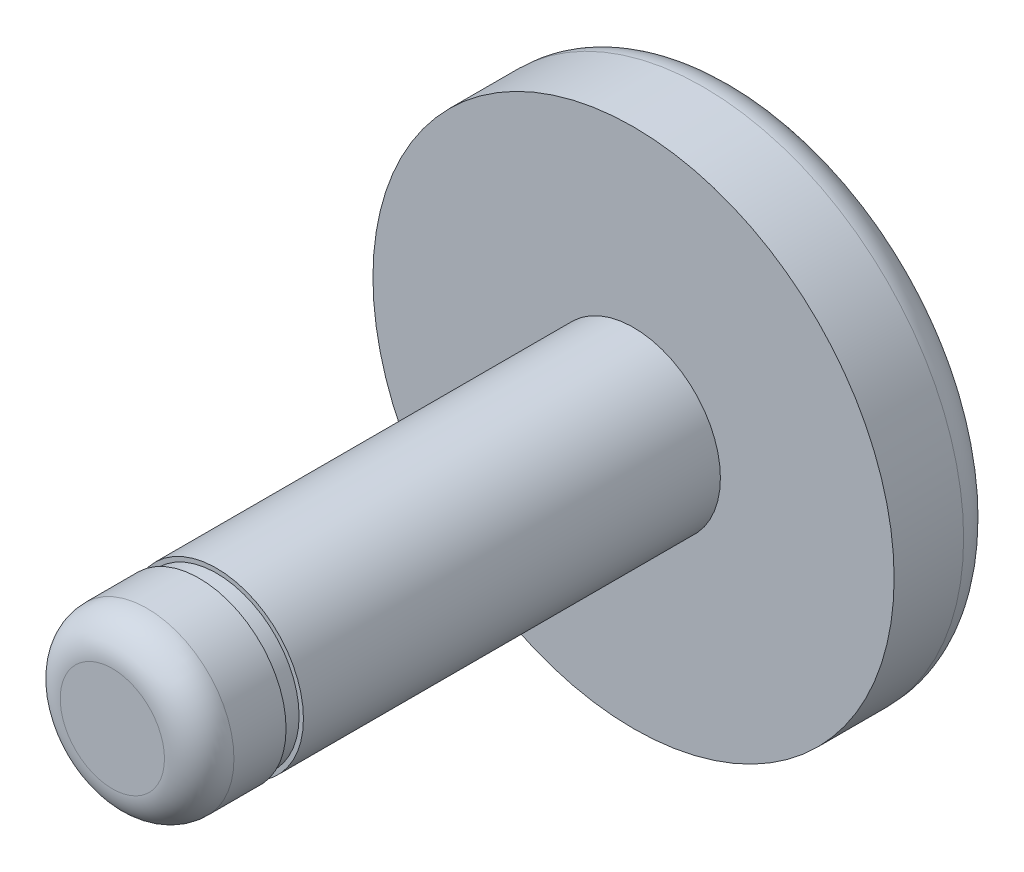
ISO-10303-21;
HEADER;
FILE_DESCRIPTION(('STEP AP214'),'2;1');
FILE_NAME('part.step','',(''),(''),'','','');
FILE_SCHEMA(('AUTOMOTIVE_DESIGN { 1 0 10303 214 1 1 1 1 }'));
ENDSEC;
DATA;
#1=APPLICATION_CONTEXT('core data for automotive mechanical design processes');
#2=APPLICATION_PROTOCOL_DEFINITION('international standard','automotive_design',2000,#1);
#3=PRODUCT_CONTEXT('',#1,'mechanical');
#4=PRODUCT('Part','Part','',(#3));
#5=PRODUCT_RELATED_PRODUCT_CATEGORY('part','',(#4));
#6=PRODUCT_DEFINITION_FORMATION('','',#4);
#7=PRODUCT_DEFINITION_CONTEXT('part definition',#1,'design');
#8=PRODUCT_DEFINITION('design','',#6,#7);
#9=PRODUCT_DEFINITION_SHAPE('','',#8);
#10=(LENGTH_UNIT() NAMED_UNIT(*) SI_UNIT(.MILLI.,.METRE.));
#11=(NAMED_UNIT(*) PLANE_ANGLE_UNIT() SI_UNIT($,.RADIAN.));
#12=(NAMED_UNIT(*) SI_UNIT($,.STERADIAN.) SOLID_ANGLE_UNIT());
#13=UNCERTAINTY_MEASURE_WITH_UNIT(LENGTH_MEASURE(1.E-05),#10,'distance_accuracy_value','');
#14=(GEOMETRIC_REPRESENTATION_CONTEXT(3) GLOBAL_UNCERTAINTY_ASSIGNED_CONTEXT((#13)) GLOBAL_UNIT_ASSIGNED_CONTEXT((#10,
#11,#12)) REPRESENTATION_CONTEXT('',''));
#15=CARTESIAN_POINT('',(0.,0.,0.));
#16=DIRECTION('',(0.,0.,1.));
#17=DIRECTION('',(1.,0.,0.));
#18=AXIS2_PLACEMENT_3D('',#15,#16,#17);
#19=CARTESIAN_POINT('',(0.,0.,18.));
#20=DIRECTION('',(0.,0.,-1.));
#21=DIRECTION('',(-1.,0.,0.));
#22=AXIS2_PLACEMENT_3D('',#19,#20,#21);
#23=CYLINDRICAL_SURFACE('',#22,2.5);
#24=CARTESIAN_POINT('',(0.,0.,3.));
#25=DIRECTION('',(0.,0.,1.));
#26=DIRECTION('',(1.,0.,0.));
#27=AXIS2_PLACEMENT_3D('',#24,#25,#26);
#28=CIRCLE('',#27,2.5);
#29=CARTESIAN_POINT('',(2.5,0.,3.));
#30=VERTEX_POINT('',#29);
#31=EDGE_CURVE('E57',#30,#30,#28,.T.);
#32=ORIENTED_EDGE('',*,*,#31,.T.);
#33=EDGE_LOOP('',(#32));
#34=FACE_BOUND('',#33,.T.);
#35=CARTESIAN_POINT('',(0.,0.,15.));
#36=DIRECTION('',(0.,0.,1.));
#37=DIRECTION('',(1.,0.,0.));
#38=AXIS2_PLACEMENT_3D('',#35,#36,#37);
#39=CIRCLE('',#38,2.5);
#40=CARTESIAN_POINT('',(2.5,0.,15.));
#41=VERTEX_POINT('',#40);
#42=EDGE_CURVE('E51',#41,#41,#39,.T.);
#43=ORIENTED_EDGE('',*,*,#42,.F.);
#44=EDGE_LOOP('',(#43));
#45=FACE_BOUND('',#44,.T.);
#46=ADVANCED_FACE('F35',(#34,#45),#23,.T.);
#47=CARTESIAN_POINT('',(0.,0.,3.));
#48=DIRECTION('',(0.,0.,1.));
#49=DIRECTION('',(1.,0.,0.));
#50=AXIS2_PLACEMENT_3D('',#47,#48,#49);
#51=PLANE('',#50);
#52=CARTESIAN_POINT('',(0.,0.,3.));
#53=DIRECTION('',(0.,0.,1.));
#54=DIRECTION('',(1.,0.,0.));
#55=AXIS2_PLACEMENT_3D('',#52,#53,#54);
#56=CIRCLE('',#55,7.5);
#57=CARTESIAN_POINT('',(7.5,0.,3.));
#58=VERTEX_POINT('',#57);
#59=EDGE_CURVE('E68',#58,#58,#56,.T.);
#60=ORIENTED_EDGE('',*,*,#59,.T.);
#61=EDGE_LOOP('',(#60));
#62=FACE_BOUND('',#61,.T.);
#63=ORIENTED_EDGE('',*,*,#31,.F.);
#64=EDGE_LOOP('',(#63));
#65=FACE_BOUND('',#64,.T.);
#66=ADVANCED_FACE('F87',(#62,#65),#51,.T.);
#67=CARTESIAN_POINT('',(0.,0.,3.));
#68=DIRECTION('',(0.,0.,-1.));
#69=DIRECTION('',(-1.,0.,0.));
#70=AXIS2_PLACEMENT_3D('',#67,#68,#69);
#71=CYLINDRICAL_SURFACE('',#70,7.5);
#72=CARTESIAN_POINT('',(0.,0.,1.));
#73=DIRECTION('',(0.,0.,1.));
#74=DIRECTION('',(1.,0.,0.));
#75=AXIS2_PLACEMENT_3D('',#72,#73,#74);
#76=CIRCLE('',#75,7.5);
#77=CARTESIAN_POINT('',(7.5,0.,1.));
#78=VERTEX_POINT('',#77);
#79=EDGE_CURVE('E71',#78,#78,#76,.T.);
#80=ORIENTED_EDGE('',*,*,#79,.T.);
#81=EDGE_LOOP('',(#80));
#82=FACE_BOUND('',#81,.T.);
#83=ORIENTED_EDGE('',*,*,#59,.F.);
#84=EDGE_LOOP('',(#83));
#85=FACE_BOUND('',#84,.T.);
#86=ADVANCED_FACE('F84',(#82,#85),#71,.T.);
#87=CARTESIAN_POINT('',(0.,0.,0.));
#88=DIRECTION('',(0.,0.,1.));
#89=DIRECTION('',(1.,0.,0.));
#90=AXIS2_PLACEMENT_3D('',#87,#88,#89);
#91=PLANE('',#90);
#92=CARTESIAN_POINT('',(0.,0.,0.));
#93=DIRECTION('',(0.,0.,1.));
#94=DIRECTION('',(1.,0.,0.));
#95=AXIS2_PLACEMENT_3D('',#92,#93,#94);
#96=CIRCLE('',#95,6.5);
#97=CARTESIAN_POINT('',(6.5,0.,0.));
#98=VERTEX_POINT('',#97);
#99=EDGE_CURVE('E48',#98,#98,#96,.F.);
#100=ORIENTED_EDGE('',*,*,#99,.T.);
#101=EDGE_LOOP('',(#100));
#102=FACE_BOUND('',#101,.T.);
#103=ADVANCED_FACE('F76',(#102),#91,.F.);
#104=CARTESIAN_POINT('',(0.,0.,1.));
#105=DIRECTION('',(0.,0.,1.));
#106=DIRECTION('',(1.,0.,0.));
#107=AXIS2_PLACEMENT_3D('',#104,#105,#106);
#108=TOROIDAL_SURFACE('',#107,6.5,1.);
#109=ORIENTED_EDGE('',*,*,#99,.F.);
#110=EDGE_LOOP('',(#109));
#111=FACE_BOUND('',#110,.T.);
#112=ORIENTED_EDGE('',*,*,#79,.F.);
#113=EDGE_LOOP('',(#112));
#114=FACE_BOUND('',#113,.T.);
#115=ADVANCED_FACE('F78',(#111,#114),#108,.T.);
#116=CARTESIAN_POINT('',(0.,0.,15.5));
#117=DIRECTION('',(0.,0.,1.));
#118=DIRECTION('',(1.,0.,0.));
#119=AXIS2_PLACEMENT_3D('',#116,#117,#118);
#120=PLANE('',#119);
#121=CARTESIAN_POINT('',(0.,0.,15.5));
#122=DIRECTION('',(0.,0.,1.));
#123=DIRECTION('',(1.,0.,0.));
#124=AXIS2_PLACEMENT_3D('',#121,#122,#123);
#125=CIRCLE('',#124,2.375);
#126=CARTESIAN_POINT('',(2.375,0.,15.5));
#127=VERTEX_POINT('',#126);
#128=EDGE_CURVE('E53',#127,#127,#125,.T.);
#129=ORIENTED_EDGE('',*,*,#128,.T.);
#130=EDGE_LOOP('',(#129));
#131=FACE_BOUND('',#130,.T.);
#132=CARTESIAN_POINT('',(0.,0.,15.5));
#133=DIRECTION('',(0.,0.,1.));
#134=DIRECTION('',(1.,0.,0.));
#135=AXIS2_PLACEMENT_3D('',#132,#133,#134);
#136=CIRCLE('',#135,2.5);
#137=CARTESIAN_POINT('',(2.5,0.,15.5));
#138=VERTEX_POINT('',#137);
#139=EDGE_CURVE('E39',#138,#138,#136,.T.);
#140=ORIENTED_EDGE('',*,*,#139,.F.);
#141=EDGE_LOOP('',(#140));
#142=FACE_BOUND('',#141,.T.);
#143=ADVANCED_FACE('F81',(#131,#142),#120,.F.);
#144=CARTESIAN_POINT('',(0.,0.,15.));
#145=DIRECTION('',(0.,0.,1.));
#146=DIRECTION('',(1.,0.,0.));
#147=AXIS2_PLACEMENT_3D('',#144,#145,#146);
#148=PLANE('',#147);
#149=CARTESIAN_POINT('',(0.,0.,15.));
#150=DIRECTION('',(0.,0.,1.));
#151=DIRECTION('',(1.,0.,0.));
#152=AXIS2_PLACEMENT_3D('',#149,#150,#151);
#153=CIRCLE('',#152,2.375);
#154=CARTESIAN_POINT('',(2.375,0.,15.));
#155=VERTEX_POINT('',#154);
#156=EDGE_CURVE('E59',#155,#155,#153,.T.);
#157=ORIENTED_EDGE('',*,*,#156,.F.);
#158=EDGE_LOOP('',(#157));
#159=FACE_BOUND('',#158,.T.);
#160=ORIENTED_EDGE('',*,*,#42,.T.);
#161=EDGE_LOOP('',(#160));
#162=FACE_BOUND('',#161,.T.);
#163=ADVANCED_FACE('F113',(#159,#162),#148,.T.);
#164=CARTESIAN_POINT('',(0.,0.,15.5));
#165=DIRECTION('',(0.,0.,-1.));
#166=DIRECTION('',(-1.,0.,0.));
#167=AXIS2_PLACEMENT_3D('',#164,#165,#166);
#168=CYLINDRICAL_SURFACE('',#167,2.375);
#169=ORIENTED_EDGE('',*,*,#128,.F.);
#170=EDGE_LOOP('',(#169));
#171=FACE_BOUND('',#170,.T.);
#172=ORIENTED_EDGE('',*,*,#156,.T.);
#173=EDGE_LOOP('',(#172));
#174=FACE_BOUND('',#173,.T.);
#175=ADVANCED_FACE('F118',(#171,#174),#168,.T.);
#176=CARTESIAN_POINT('',(0.,0.,18.));
#177=DIRECTION('',(0.,0.,1.));
#178=DIRECTION('',(1.,0.,0.));
#179=AXIS2_PLACEMENT_3D('',#176,#177,#178);
#180=PLANE('',#179);
#181=CARTESIAN_POINT('',(0.,0.,18.));
#182=DIRECTION('',(0.,0.,1.));
#183=DIRECTION('',(1.,0.,0.));
#184=AXIS2_PLACEMENT_3D('',#181,#182,#183);
#185=CIRCLE('',#184,1.5);
#186=CARTESIAN_POINT('',(1.5,0.,18.));
#187=VERTEX_POINT('',#186);
#188=EDGE_CURVE('E43',#187,#187,#185,.T.);
#189=ORIENTED_EDGE('',*,*,#188,.T.);
#190=EDGE_LOOP('',(#189));
#191=FACE_BOUND('',#190,.T.);
#192=ADVANCED_FACE('F108',(#191),#180,.T.);
#193=CARTESIAN_POINT('',(0.,0.,17.));
#194=DIRECTION('',(0.,0.,1.));
#195=DIRECTION('',(1.,0.,0.));
#196=AXIS2_PLACEMENT_3D('',#193,#194,#195);
#197=TOROIDAL_SURFACE('',#196,1.5,1.);
#198=CARTESIAN_POINT('',(0.,0.,17.));
#199=DIRECTION('',(0.,0.,1.));
#200=DIRECTION('',(1.,0.,0.));
#201=AXIS2_PLACEMENT_3D('',#198,#199,#200);
#202=CIRCLE('',#201,2.5);
#203=CARTESIAN_POINT('',(2.5,0.,17.));
#204=VERTEX_POINT('',#203);
#205=EDGE_CURVE('E11',#204,#204,#202,.F.);
#206=ORIENTED_EDGE('',*,*,#205,.F.);
#207=EDGE_LOOP('',(#206));
#208=FACE_BOUND('',#207,.T.);
#209=ORIENTED_EDGE('',*,*,#188,.F.);
#210=EDGE_LOOP('',(#209));
#211=FACE_BOUND('',#210,.T.);
#212=ADVANCED_FACE('F37',(#208,#211),#197,.T.);
#213=ORIENTED_EDGE('',*,*,#139,.T.);
#214=EDGE_LOOP('',(#213));
#215=FACE_BOUND('',#214,.T.);
#216=ORIENTED_EDGE('',*,*,#205,.T.);
#217=EDGE_LOOP('',(#216));
#218=FACE_BOUND('',#217,.T.);
#219=ADVANCED_FACE('F99',(#215,#218),#23,.T.);
#220=CLOSED_SHELL('',(#46,#66,#86,#103,#115,#143,#163,#175,#192,#212,#219));
#221=MANIFOLD_SOLID_BREP('B2',#220);
#222=ADVANCED_BREP_SHAPE_REPRESENTATION('',(#18,#221),#14);
#223=SHAPE_DEFINITION_REPRESENTATION(#9,#222);
ENDSEC;
END-ISO-10303-21;
